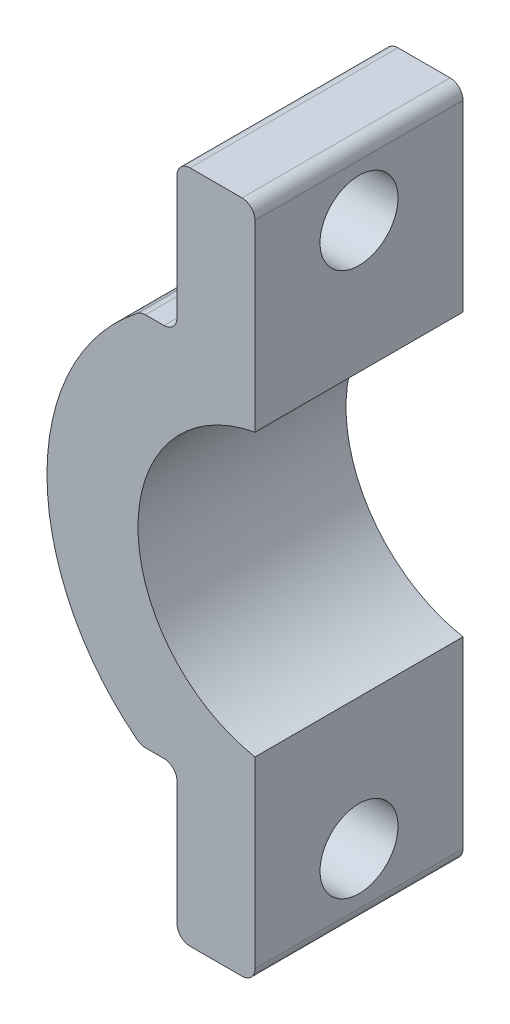
ISO-10303-21;
HEADER;
FILE_DESCRIPTION(('STEP AP214'),'2;1');
FILE_NAME('part.step','',(''),(''),'','','');
FILE_SCHEMA(('AUTOMOTIVE_DESIGN { 1 0 10303 214 1 1 1 1 }'));
ENDSEC;
DATA;
#1=APPLICATION_CONTEXT('core data for automotive mechanical design processes');
#2=APPLICATION_PROTOCOL_DEFINITION('international standard','automotive_design',2000,#1);
#3=PRODUCT_CONTEXT('',#1,'mechanical');
#4=PRODUCT('Part','Part','',(#3));
#5=PRODUCT_RELATED_PRODUCT_CATEGORY('part','',(#4));
#6=PRODUCT_DEFINITION_FORMATION('','',#4);
#7=PRODUCT_DEFINITION_CONTEXT('part definition',#1,'design');
#8=PRODUCT_DEFINITION('design','',#6,#7);
#9=PRODUCT_DEFINITION_SHAPE('','',#8);
#10=(LENGTH_UNIT() NAMED_UNIT(*) SI_UNIT(.MILLI.,.METRE.));
#11=(NAMED_UNIT(*) PLANE_ANGLE_UNIT() SI_UNIT($,.RADIAN.));
#12=(NAMED_UNIT(*) SI_UNIT($,.STERADIAN.) SOLID_ANGLE_UNIT());
#13=UNCERTAINTY_MEASURE_WITH_UNIT(LENGTH_MEASURE(1.E-05),#10,'distance_accuracy_value','');
#14=(GEOMETRIC_REPRESENTATION_CONTEXT(3) GLOBAL_UNCERTAINTY_ASSIGNED_CONTEXT((#13)) GLOBAL_UNIT_ASSIGNED_CONTEXT((#10,
#11,#12)) REPRESENTATION_CONTEXT('',''));
#15=CARTESIAN_POINT('',(0.,0.,0.));
#16=DIRECTION('',(0.,0.,1.));
#17=DIRECTION('',(1.,0.,0.));
#18=AXIS2_PLACEMENT_3D('',#15,#16,#17);
#19=CARTESIAN_POINT('',(0.,0.,8.));
#20=DIRECTION('',(0.,0.,1.));
#21=DIRECTION('',(1.,0.,0.));
#22=AXIS2_PLACEMENT_3D('',#19,#20,#21);
#23=PLANE('',#22);
#24=CARTESIAN_POINT('',(0.,0.,8.));
#25=DIRECTION('',(0.,0.,-1.));
#26=DIRECTION('',(1.,0.,0.));
#27=AXIS2_PLACEMENT_3D('',#24,#25,#26);
#28=CIRCLE('',#27,9.);
#29=CARTESIAN_POINT('',(-5.52275871873927,-7.10627442015782,8.));
#30=VERTEX_POINT('',#29);
#31=CARTESIAN_POINT('',(-5.52275871873927,7.10627442015782,8.));
#32=VERTEX_POINT('',#31);
#33=EDGE_CURVE('E271',#30,#32,#28,.T.);
#34=ORIENTED_EDGE('',*,*,#33,.F.);
#35=CARTESIAN_POINT('',(-5.21593878992042,-6.71148139681572,8.));
#36=DIRECTION('',(0.,0.,1.));
#37=DIRECTION('',(1.,0.,0.));
#38=AXIS2_PLACEMENT_3D('',#35,#36,#37);
#39=CIRCLE('',#38,0.5);
#40=CARTESIAN_POINT('',(-5.21593878992042,-7.21148139681572,8.));
#41=VERTEX_POINT('',#40);
#42=EDGE_CURVE('E43',#30,#41,#39,.T.);
#43=ORIENTED_EDGE('',*,*,#42,.T.);
#44=DIRECTION('',(-1.,0.,0.));
#45=VECTOR('',#44,1.);
#46=CARTESIAN_POINT('',(-4.,-7.21148139681572,8.));
#47=LINE('',#46,#45);
#48=CARTESIAN_POINT('',(-4.5,-7.21148139681572,8.));
#49=VERTEX_POINT('',#48);
#50=EDGE_CURVE('E270',#49,#41,#47,.T.);
#51=ORIENTED_EDGE('',*,*,#50,.F.);
#52=CARTESIAN_POINT('',(-4.5,-7.71148139681572,8.));
#53=DIRECTION('',(0.,0.,1.));
#54=DIRECTION('',(1.,0.,0.));
#55=AXIS2_PLACEMENT_3D('',#52,#53,#54);
#56=CIRCLE('',#55,0.5);
#57=CARTESIAN_POINT('',(-4.,-7.71148139681572,8.));
#58=VERTEX_POINT('',#57);
#59=EDGE_CURVE('E230',#49,#58,#56,.F.);
#60=ORIENTED_EDGE('',*,*,#59,.T.);
#61=DIRECTION('',(0.,1.,0.));
#62=VECTOR('',#61,1.);
#63=CARTESIAN_POINT('',(-4.,-7.21148139681572,8.));
#64=LINE('',#63,#62);
#65=CARTESIAN_POINT('',(-4.,-12.4614813968157,8.));
#66=VERTEX_POINT('',#65);
#67=EDGE_CURVE('E281',#66,#58,#64,.T.);
#68=ORIENTED_EDGE('',*,*,#67,.F.);
#69=CARTESIAN_POINT('',(-3.5,-12.4614813968157,8.));
#70=DIRECTION('',(0.,0.,1.));
#71=DIRECTION('',(1.,0.,0.));
#72=AXIS2_PLACEMENT_3D('',#69,#70,#71);
#73=CIRCLE('',#72,0.5);
#74=CARTESIAN_POINT('',(-3.5,-12.9614813968157,8.));
#75=VERTEX_POINT('',#74);
#76=EDGE_CURVE('E211',#66,#75,#73,.T.);
#77=ORIENTED_EDGE('',*,*,#76,.T.);
#78=DIRECTION('',(-1.,0.,0.));
#79=VECTOR('',#78,1.);
#80=CARTESIAN_POINT('',(-4.,-12.9614813968157,8.));
#81=LINE('',#80,#79);
#82=CARTESIAN_POINT('',(-1.5,-12.9614813968157,8.));
#83=VERTEX_POINT('',#82);
#84=EDGE_CURVE('E328',#83,#75,#81,.T.);
#85=ORIENTED_EDGE('',*,*,#84,.F.);
#86=CARTESIAN_POINT('',(-1.5,-12.4614813968157,8.));
#87=DIRECTION('',(0.,0.,1.));
#88=DIRECTION('',(1.,0.,0.));
#89=AXIS2_PLACEMENT_3D('',#86,#87,#88);
#90=CIRCLE('',#89,0.5);
#91=CARTESIAN_POINT('',(-1.,-12.4614813968157,8.));
#92=VERTEX_POINT('',#91);
#93=EDGE_CURVE('E177',#83,#92,#90,.T.);
#94=ORIENTED_EDGE('',*,*,#93,.T.);
#95=DIRECTION('',(0.,-1.,0.));
#96=VECTOR('',#95,1.);
#97=CARTESIAN_POINT('',(-1.,24.2431667663396,8.));
#98=LINE('',#97,#96);
#99=CARTESIAN_POINT('',(-1.,-5.40832691319598,8.));
#100=VERTEX_POINT('',#99);
#101=EDGE_CURVE('E163',#100,#92,#98,.T.);
#102=ORIENTED_EDGE('',*,*,#101,.F.);
#103=CARTESIAN_POINT('',(0.,0.,8.));
#104=DIRECTION('',(0.,0.,1.));
#105=DIRECTION('',(1.,0.,0.));
#106=AXIS2_PLACEMENT_3D('',#103,#104,#105);
#107=CIRCLE('',#106,5.5);
#108=CARTESIAN_POINT('',(-1.,5.40832691319598,8.));
#109=VERTEX_POINT('',#108);
#110=EDGE_CURVE('E172',#109,#100,#107,.T.);
#111=ORIENTED_EDGE('',*,*,#110,.F.);
#112=CARTESIAN_POINT('',(-1.,12.4614813968157,8.));
#113=VERTEX_POINT('',#112);
#114=EDGE_CURVE('E178',#113,#109,#98,.T.);
#115=ORIENTED_EDGE('',*,*,#114,.F.);
#116=CARTESIAN_POINT('',(-1.5,12.4614813968157,8.));
#117=DIRECTION('',(0.,0.,1.));
#118=DIRECTION('',(1.,0.,0.));
#119=AXIS2_PLACEMENT_3D('',#116,#117,#118);
#120=CIRCLE('',#119,0.5);
#121=CARTESIAN_POINT('',(-1.5,12.9614813968157,8.));
#122=VERTEX_POINT('',#121);
#123=EDGE_CURVE('E242',#113,#122,#120,.T.);
#124=ORIENTED_EDGE('',*,*,#123,.T.);
#125=DIRECTION('',(1.,0.,0.));
#126=VECTOR('',#125,1.);
#127=CARTESIAN_POINT('',(-4.,12.9614813968157,8.));
#128=LINE('',#127,#126);
#129=CARTESIAN_POINT('',(-3.5,12.9614813968157,8.));
#130=VERTEX_POINT('',#129);
#131=EDGE_CURVE('E296',#130,#122,#128,.T.);
#132=ORIENTED_EDGE('',*,*,#131,.F.);
#133=CARTESIAN_POINT('',(-3.5,12.4614813968157,8.));
#134=DIRECTION('',(0.,0.,1.));
#135=DIRECTION('',(1.,0.,0.));
#136=AXIS2_PLACEMENT_3D('',#133,#134,#135);
#137=CIRCLE('',#136,0.5);
#138=CARTESIAN_POINT('',(-4.,12.4614813968157,8.));
#139=VERTEX_POINT('',#138);
#140=EDGE_CURVE('E208',#130,#139,#137,.T.);
#141=ORIENTED_EDGE('',*,*,#140,.T.);
#142=DIRECTION('',(0.,1.,0.));
#143=VECTOR('',#142,1.);
#144=CARTESIAN_POINT('',(-4.,21.0444914195402,8.));
#145=LINE('',#144,#143);
#146=CARTESIAN_POINT('',(-4.,7.71148139681573,8.));
#147=VERTEX_POINT('',#146);
#148=EDGE_CURVE('E304',#147,#139,#145,.T.);
#149=ORIENTED_EDGE('',*,*,#148,.F.);
#150=CARTESIAN_POINT('',(-4.5,7.71148139681572,8.));
#151=DIRECTION('',(0.,0.,1.));
#152=DIRECTION('',(1.,0.,0.));
#153=AXIS2_PLACEMENT_3D('',#150,#151,#152);
#154=CIRCLE('',#153,0.5);
#155=CARTESIAN_POINT('',(-4.5,7.21148139681572,8.));
#156=VERTEX_POINT('',#155);
#157=EDGE_CURVE('E234',#147,#156,#154,.F.);
#158=ORIENTED_EDGE('',*,*,#157,.T.);
#159=DIRECTION('',(1.,0.,0.));
#160=VECTOR('',#159,1.);
#161=CARTESIAN_POINT('',(-28.8712300204423,7.21148139681572,8.));
#162=LINE('',#161,#160);
#163=CARTESIAN_POINT('',(-5.21593878992042,7.21148139681572,8.));
#164=VERTEX_POINT('',#163);
#165=EDGE_CURVE('E306',#164,#156,#162,.T.);
#166=ORIENTED_EDGE('',*,*,#165,.F.);
#167=CARTESIAN_POINT('',(-5.21593878992042,6.71148139681572,8.));
#168=DIRECTION('',(0.,0.,1.));
#169=DIRECTION('',(1.,0.,0.));
#170=AXIS2_PLACEMENT_3D('',#167,#168,#169);
#171=CIRCLE('',#170,0.5);
#172=EDGE_CURVE('E50',#164,#32,#171,.T.);
#173=ORIENTED_EDGE('',*,*,#172,.T.);
#174=EDGE_LOOP('',(#34,#43,#51,#60,#68,#77,#85,#94,#102,#111,#115,#124,#132,#141,#149,#158,#166,#173));
#175=FACE_BOUND('',#174,.T.);
#176=ADVANCED_FACE('F35',(#175),#23,.T.);
#177=CARTESIAN_POINT('',(0.,0.,0.));
#178=DIRECTION('',(0.,0.,1.));
#179=DIRECTION('',(1.,0.,0.));
#180=AXIS2_PLACEMENT_3D('',#177,#178,#179);
#181=PLANE('',#180);
#182=DIRECTION('',(-1.,0.,0.));
#183=VECTOR('',#182,1.);
#184=CARTESIAN_POINT('',(-4.,-7.21148139681572,0.));
#185=LINE('',#184,#183);
#186=CARTESIAN_POINT('',(-4.5,-7.21148139681572,0.));
#187=VERTEX_POINT('',#186);
#188=CARTESIAN_POINT('',(-5.21593878992042,-7.21148139681572,0.));
#189=VERTEX_POINT('',#188);
#190=EDGE_CURVE('E290',#187,#189,#185,.T.);
#191=ORIENTED_EDGE('',*,*,#190,.T.);
#192=CARTESIAN_POINT('',(-5.21593878992042,-6.71148139681572,0.));
#193=DIRECTION('',(0.,0.,1.));
#194=DIRECTION('',(1.,0.,0.));
#195=AXIS2_PLACEMENT_3D('',#192,#193,#194);
#196=CIRCLE('',#195,0.5);
#197=CARTESIAN_POINT('',(-5.52275871873927,-7.10627442015782,0.));
#198=VERTEX_POINT('',#197);
#199=EDGE_CURVE('E261',#189,#198,#196,.F.);
#200=ORIENTED_EDGE('',*,*,#199,.T.);
#201=CARTESIAN_POINT('',(0.,0.,0.));
#202=DIRECTION('',(0.,0.,-1.));
#203=DIRECTION('',(1.,0.,0.));
#204=AXIS2_PLACEMENT_3D('',#201,#202,#203);
#205=CIRCLE('',#204,9.);
#206=CARTESIAN_POINT('',(-5.52275871873927,7.10627442015782,0.));
#207=VERTEX_POINT('',#206);
#208=EDGE_CURVE('E288',#198,#207,#205,.T.);
#209=ORIENTED_EDGE('',*,*,#208,.T.);
#210=CARTESIAN_POINT('',(-5.21593878992042,6.71148139681572,0.));
#211=DIRECTION('',(0.,0.,1.));
#212=DIRECTION('',(1.,0.,0.));
#213=AXIS2_PLACEMENT_3D('',#210,#211,#212);
#214=CIRCLE('',#213,0.5);
#215=CARTESIAN_POINT('',(-5.21593878992042,7.21148139681572,0.));
#216=VERTEX_POINT('',#215);
#217=EDGE_CURVE('E259',#207,#216,#214,.F.);
#218=ORIENTED_EDGE('',*,*,#217,.T.);
#219=DIRECTION('',(1.,0.,0.));
#220=VECTOR('',#219,1.);
#221=CARTESIAN_POINT('',(-28.8712300204423,7.21148139681572,0.));
#222=LINE('',#221,#220);
#223=CARTESIAN_POINT('',(-4.5,7.21148139681572,0.));
#224=VERTEX_POINT('',#223);
#225=EDGE_CURVE('E302',#216,#224,#222,.T.);
#226=ORIENTED_EDGE('',*,*,#225,.T.);
#227=CARTESIAN_POINT('',(-4.5,7.71148139681572,0.));
#228=DIRECTION('',(0.,0.,1.));
#229=DIRECTION('',(1.,0.,0.));
#230=AXIS2_PLACEMENT_3D('',#227,#228,#229);
#231=CIRCLE('',#230,0.5);
#232=CARTESIAN_POINT('',(-4.,7.71148139681573,0.));
#233=VERTEX_POINT('',#232);
#234=EDGE_CURVE('E237',#224,#233,#231,.T.);
#235=ORIENTED_EDGE('',*,*,#234,.T.);
#236=DIRECTION('',(0.,1.,0.));
#237=VECTOR('',#236,1.);
#238=CARTESIAN_POINT('',(-4.,21.0444914195402,0.));
#239=LINE('',#238,#237);
#240=CARTESIAN_POINT('',(-4.,12.4614813968157,0.));
#241=VERTEX_POINT('',#240);
#242=EDGE_CURVE('E179',#233,#241,#239,.T.);
#243=ORIENTED_EDGE('',*,*,#242,.T.);
#244=CARTESIAN_POINT('',(-3.5,12.4614813968157,0.));
#245=DIRECTION('',(0.,0.,1.));
#246=DIRECTION('',(1.,0.,0.));
#247=AXIS2_PLACEMENT_3D('',#244,#245,#246);
#248=CIRCLE('',#247,0.5);
#249=CARTESIAN_POINT('',(-3.5,12.9614813968157,0.));
#250=VERTEX_POINT('',#249);
#251=EDGE_CURVE('E202',#241,#250,#248,.F.);
#252=ORIENTED_EDGE('',*,*,#251,.T.);
#253=DIRECTION('',(1.,0.,0.));
#254=VECTOR('',#253,1.);
#255=CARTESIAN_POINT('',(-4.,12.9614813968157,0.));
#256=LINE('',#255,#254);
#257=CARTESIAN_POINT('',(-1.5,12.9614813968157,0.));
#258=VERTEX_POINT('',#257);
#259=EDGE_CURVE('E299',#250,#258,#256,.T.);
#260=ORIENTED_EDGE('',*,*,#259,.T.);
#261=CARTESIAN_POINT('',(-1.5,12.4614813968157,0.));
#262=DIRECTION('',(0.,0.,1.));
#263=DIRECTION('',(1.,0.,0.));
#264=AXIS2_PLACEMENT_3D('',#261,#262,#263);
#265=CIRCLE('',#264,0.5);
#266=CARTESIAN_POINT('',(-1.,12.4614813968157,0.));
#267=VERTEX_POINT('',#266);
#268=EDGE_CURVE('E247',#258,#267,#265,.F.);
#269=ORIENTED_EDGE('',*,*,#268,.T.);
#270=DIRECTION('',(0.,-1.,0.));
#271=VECTOR('',#270,1.);
#272=CARTESIAN_POINT('',(-1.,24.2431667663396,0.));
#273=LINE('',#272,#271);
#274=CARTESIAN_POINT('',(-1.,5.40832691319598,0.));
#275=VERTEX_POINT('',#274);
#276=EDGE_CURVE('E186',#267,#275,#273,.T.);
#277=ORIENTED_EDGE('',*,*,#276,.T.);
#278=CARTESIAN_POINT('',(0.,0.,0.));
#279=DIRECTION('',(0.,0.,1.));
#280=DIRECTION('',(1.,0.,0.));
#281=AXIS2_PLACEMENT_3D('',#278,#279,#280);
#282=CIRCLE('',#281,5.5);
#283=CARTESIAN_POINT('',(-1.,-5.40832691319598,0.));
#284=VERTEX_POINT('',#283);
#285=EDGE_CURVE('E184',#275,#284,#282,.T.);
#286=ORIENTED_EDGE('',*,*,#285,.T.);
#287=CARTESIAN_POINT('',(-1.,-12.4614813968157,0.));
#288=VERTEX_POINT('',#287);
#289=EDGE_CURVE('E166',#284,#288,#273,.T.);
#290=ORIENTED_EDGE('',*,*,#289,.T.);
#291=CARTESIAN_POINT('',(-1.5,-12.4614813968157,0.));
#292=DIRECTION('',(0.,0.,1.));
#293=DIRECTION('',(1.,0.,0.));
#294=AXIS2_PLACEMENT_3D('',#291,#292,#293);
#295=CIRCLE('',#294,0.5);
#296=CARTESIAN_POINT('',(-1.5,-12.9614813968157,0.));
#297=VERTEX_POINT('',#296);
#298=EDGE_CURVE('E249',#288,#297,#295,.F.);
#299=ORIENTED_EDGE('',*,*,#298,.T.);
#300=DIRECTION('',(-1.,0.,0.));
#301=VECTOR('',#300,1.);
#302=CARTESIAN_POINT('',(-4.,-12.9614813968157,0.));
#303=LINE('',#302,#301);
#304=CARTESIAN_POINT('',(-3.5,-12.9614813968157,0.));
#305=VERTEX_POINT('',#304);
#306=EDGE_CURVE('E199',#297,#305,#303,.T.);
#307=ORIENTED_EDGE('',*,*,#306,.T.);
#308=CARTESIAN_POINT('',(-3.5,-12.4614813968157,0.));
#309=DIRECTION('',(0.,0.,1.));
#310=DIRECTION('',(1.,0.,0.));
#311=AXIS2_PLACEMENT_3D('',#308,#309,#310);
#312=CIRCLE('',#311,0.5);
#313=CARTESIAN_POINT('',(-4.,-12.4614813968157,0.));
#314=VERTEX_POINT('',#313);
#315=EDGE_CURVE('E204',#305,#314,#312,.F.);
#316=ORIENTED_EDGE('',*,*,#315,.T.);
#317=DIRECTION('',(0.,1.,0.));
#318=VECTOR('',#317,1.);
#319=CARTESIAN_POINT('',(-4.,-7.21148139681572,0.));
#320=LINE('',#319,#318);
#321=CARTESIAN_POINT('',(-4.,-7.71148139681572,0.));
#322=VERTEX_POINT('',#321);
#323=EDGE_CURVE('E280',#314,#322,#320,.T.);
#324=ORIENTED_EDGE('',*,*,#323,.T.);
#325=CARTESIAN_POINT('',(-4.5,-7.71148139681572,0.));
#326=DIRECTION('',(0.,0.,1.));
#327=DIRECTION('',(1.,0.,0.));
#328=AXIS2_PLACEMENT_3D('',#325,#326,#327);
#329=CIRCLE('',#328,0.5);
#330=EDGE_CURVE('E232',#322,#187,#329,.T.);
#331=ORIENTED_EDGE('',*,*,#330,.T.);
#332=EDGE_LOOP('',(#191,#200,#209,#218,#226,#235,#243,#252,#260,#269,#277,#286,#290,#299,#307,
#316,#324,#331));
#333=FACE_BOUND('',#332,.T.);
#334=ADVANCED_FACE('F287',(#333),#181,.F.);
#335=CARTESIAN_POINT('',(0.,0.,8.));
#336=DIRECTION('',(0.,0.,-1.));
#337=DIRECTION('',(-1.,0.,0.));
#338=AXIS2_PLACEMENT_3D('',#335,#336,#337);
#339=CYLINDRICAL_SURFACE('',#338,5.5);
#340=DIRECTION('',(0.,0.,-1.));
#341=VECTOR('',#340,1.);
#342=CARTESIAN_POINT('',(-1.,5.40832691319598,8.));
#343=LINE('',#342,#341);
#344=EDGE_CURVE('E171',#109,#275,#343,.T.);
#345=ORIENTED_EDGE('',*,*,#344,.F.);
#346=ORIENTED_EDGE('',*,*,#110,.T.);
#347=DIRECTION('',(0.,0.,-1.));
#348=VECTOR('',#347,1.);
#349=CARTESIAN_POINT('',(-1.,-5.40832691319598,8.));
#350=LINE('',#349,#348);
#351=EDGE_CURVE('E160',#284,#100,#350,.F.);
#352=ORIENTED_EDGE('',*,*,#351,.F.);
#353=ORIENTED_EDGE('',*,*,#285,.F.);
#354=EDGE_LOOP('',(#345,#346,#352,#353));
#355=FACE_BOUND('',#354,.T.);
#356=ADVANCED_FACE('F182',(#355),#339,.F.);
#357=CARTESIAN_POINT('',(-1.,24.2431667663396,0.));
#358=DIRECTION('',(-1.,0.,0.));
#359=DIRECTION('',(0.,-1.,0.));
#360=AXIS2_PLACEMENT_3D('',#357,#358,#359);
#361=PLANE('',#360);
#362=CARTESIAN_POINT('',(-1.,-10.4614813968157,4.));
#363=DIRECTION('',(1.,0.,0.));
#364=DIRECTION('',(0.,1.,0.));
#365=AXIS2_PLACEMENT_3D('',#362,#363,#364);
#366=CIRCLE('',#365,1.5);
#367=CARTESIAN_POINT('',(-1.,-8.96148139681572,4.));
#368=VERTEX_POINT('',#367);
#369=EDGE_CURVE('E333',#368,#368,#366,.T.);
#370=ORIENTED_EDGE('',*,*,#369,.F.);
#371=EDGE_LOOP('',(#370));
#372=FACE_BOUND('',#371,.T.);
#373=ORIENTED_EDGE('',*,*,#101,.T.);
#374=DIRECTION('',(0.,0.,1.));
#375=VECTOR('',#374,1.);
#376=CARTESIAN_POINT('',(-1.,-12.4614813968157,0.));
#377=LINE('',#376,#375);
#378=EDGE_CURVE('E245',#92,#288,#377,.F.);
#379=ORIENTED_EDGE('',*,*,#378,.T.);
#380=ORIENTED_EDGE('',*,*,#289,.F.);
#381=ORIENTED_EDGE('',*,*,#351,.T.);
#382=EDGE_LOOP('',(#373,#379,#380,#381));
#383=FACE_BOUND('',#382,.T.);
#384=ADVANCED_FACE('F162',(#372,#383),#361,.F.);
#385=CARTESIAN_POINT('',(-1.,10.4614813968157,4.));
#386=DIRECTION('',(1.,0.,0.));
#387=DIRECTION('',(0.,1.,0.));
#388=AXIS2_PLACEMENT_3D('',#385,#386,#387);
#389=CIRCLE('',#388,1.5);
#390=CARTESIAN_POINT('',(-1.,11.9614813968157,4.));
#391=VERTEX_POINT('',#390);
#392=EDGE_CURVE('E196',#391,#391,#389,.T.);
#393=ORIENTED_EDGE('',*,*,#392,.F.);
#394=EDGE_LOOP('',(#393));
#395=FACE_BOUND('',#394,.T.);
#396=ORIENTED_EDGE('',*,*,#276,.F.);
#397=DIRECTION('',(0.,0.,-1.));
#398=VECTOR('',#397,1.);
#399=CARTESIAN_POINT('',(-1.,12.4614813968157,8.));
#400=LINE('',#399,#398);
#401=EDGE_CURVE('E254',#267,#113,#400,.F.);
#402=ORIENTED_EDGE('',*,*,#401,.T.);
#403=ORIENTED_EDGE('',*,*,#114,.T.);
#404=ORIENTED_EDGE('',*,*,#344,.T.);
#405=EDGE_LOOP('',(#396,#402,#403,#404));
#406=FACE_BOUND('',#405,.T.);
#407=ADVANCED_FACE('F314',(#395,#406),#361,.F.);
#408=CARTESIAN_POINT('',(-4.,-7.21148139681572,0.));
#409=DIRECTION('',(0.,1.,0.));
#410=DIRECTION('',(-1.,0.,0.));
#411=AXIS2_PLACEMENT_3D('',#408,#409,#410);
#412=PLANE('',#411);
#413=ORIENTED_EDGE('',*,*,#50,.T.);
#414=DIRECTION('',(0.,0.,1.));
#415=VECTOR('',#414,1.);
#416=CARTESIAN_POINT('',(-5.21593878992042,-7.21148139681572,0.));
#417=LINE('',#416,#415);
#418=EDGE_CURVE('E256',#41,#189,#417,.F.);
#419=ORIENTED_EDGE('',*,*,#418,.T.);
#420=ORIENTED_EDGE('',*,*,#190,.F.);
#421=DIRECTION('',(0.,0.,1.));
#422=VECTOR('',#421,1.);
#423=CARTESIAN_POINT('',(-4.5,-7.21148139681572,8.));
#424=LINE('',#423,#422);
#425=EDGE_CURVE('E219',#187,#49,#424,.T.);
#426=ORIENTED_EDGE('',*,*,#425,.T.);
#427=EDGE_LOOP('',(#413,#419,#420,#426));
#428=FACE_BOUND('',#427,.T.);
#429=ADVANCED_FACE('F276',(#428),#412,.F.);
#430=CARTESIAN_POINT('',(-4.,-7.21148139681572,0.));
#431=DIRECTION('',(1.,0.,0.));
#432=DIRECTION('',(0.,1.,0.));
#433=AXIS2_PLACEMENT_3D('',#430,#431,#432);
#434=PLANE('',#433);
#435=CARTESIAN_POINT('',(-4.,-10.4614813968157,4.));
#436=DIRECTION('',(1.,0.,0.));
#437=DIRECTION('',(0.,1.,0.));
#438=AXIS2_PLACEMENT_3D('',#435,#436,#437);
#439=CIRCLE('',#438,1.5);
#440=CARTESIAN_POINT('',(-4.,-8.96148139681572,4.));
#441=VERTEX_POINT('',#440);
#442=EDGE_CURVE('E195',#441,#441,#439,.T.);
#443=ORIENTED_EDGE('',*,*,#442,.T.);
#444=EDGE_LOOP('',(#443));
#445=FACE_BOUND('',#444,.T.);
#446=ORIENTED_EDGE('',*,*,#67,.T.);
#447=DIRECTION('',(0.,0.,1.));
#448=VECTOR('',#447,1.);
#449=CARTESIAN_POINT('',(-4.,-7.71148139681572,0.));
#450=LINE('',#449,#448);
#451=EDGE_CURVE('E222',#58,#322,#450,.F.);
#452=ORIENTED_EDGE('',*,*,#451,.T.);
#453=ORIENTED_EDGE('',*,*,#323,.F.);
#454=DIRECTION('',(0.,0.,-1.));
#455=VECTOR('',#454,1.);
#456=CARTESIAN_POINT('',(-4.,-12.4614813968157,8.));
#457=LINE('',#456,#455);
#458=EDGE_CURVE('E206',#314,#66,#457,.F.);
#459=ORIENTED_EDGE('',*,*,#458,.T.);
#460=EDGE_LOOP('',(#446,#452,#453,#459));
#461=FACE_BOUND('',#460,.T.);
#462=ADVANCED_FACE('F349',(#445,#461),#434,.F.);
#463=CARTESIAN_POINT('',(-28.8712300204423,7.21148139681572,0.));
#464=DIRECTION('',(0.,-1.,0.));
#465=DIRECTION('',(0.,0.,-1.));
#466=AXIS2_PLACEMENT_3D('',#463,#464,#465);
#467=PLANE('',#466);
#468=ORIENTED_EDGE('',*,*,#225,.F.);
#469=DIRECTION('',(0.,0.,1.));
#470=VECTOR('',#469,1.);
#471=CARTESIAN_POINT('',(-5.21593878992042,7.21148139681572,0.));
#472=LINE('',#471,#470);
#473=EDGE_CURVE('E11',#216,#164,#472,.T.);
#474=ORIENTED_EDGE('',*,*,#473,.T.);
#475=ORIENTED_EDGE('',*,*,#165,.T.);
#476=DIRECTION('',(0.,0.,1.));
#477=VECTOR('',#476,1.);
#478=CARTESIAN_POINT('',(-4.5,7.21148139681572,0.));
#479=LINE('',#478,#477);
#480=EDGE_CURVE('E227',#156,#224,#479,.F.);
#481=ORIENTED_EDGE('',*,*,#480,.T.);
#482=EDGE_LOOP('',(#468,#474,#475,#481));
#483=FACE_BOUND('',#482,.T.);
#484=ADVANCED_FACE('F392',(#483),#467,.F.);
#485=CARTESIAN_POINT('',(-4.,21.0444914195402,0.));
#486=DIRECTION('',(1.,0.,0.));
#487=DIRECTION('',(0.,0.,-1.));
#488=AXIS2_PLACEMENT_3D('',#485,#486,#487);
#489=PLANE('',#488);
#490=CARTESIAN_POINT('',(-4.,10.4614813968157,4.));
#491=DIRECTION('',(1.,0.,0.));
#492=DIRECTION('',(0.,0.,-1.));
#493=AXIS2_PLACEMENT_3D('',#490,#491,#492);
#494=CIRCLE('',#493,1.5);
#495=CARTESIAN_POINT('',(-4.,10.4614813968157,2.5));
#496=VERTEX_POINT('',#495);
#497=EDGE_CURVE('E192',#496,#496,#494,.T.);
#498=ORIENTED_EDGE('',*,*,#497,.T.);
#499=EDGE_LOOP('',(#498));
#500=FACE_BOUND('',#499,.T.);
#501=ORIENTED_EDGE('',*,*,#242,.F.);
#502=DIRECTION('',(0.,0.,1.));
#503=VECTOR('',#502,1.);
#504=CARTESIAN_POINT('',(-4.,7.71148139681572,8.));
#505=LINE('',#504,#503);
#506=EDGE_CURVE('E224',#233,#147,#505,.T.);
#507=ORIENTED_EDGE('',*,*,#506,.T.);
#508=ORIENTED_EDGE('',*,*,#148,.T.);
#509=DIRECTION('',(0.,0.,-1.));
#510=VECTOR('',#509,1.);
#511=CARTESIAN_POINT('',(-4.,12.4614813968157,0.));
#512=LINE('',#511,#510);
#513=EDGE_CURVE('E214',#139,#241,#512,.T.);
#514=ORIENTED_EDGE('',*,*,#513,.T.);
#515=EDGE_LOOP('',(#501,#507,#508,#514));
#516=FACE_BOUND('',#515,.T.);
#517=ADVANCED_FACE('F398',(#500,#516),#489,.F.);
#518=CARTESIAN_POINT('',(0.,0.,0.));
#519=DIRECTION('',(0.,0.,1.));
#520=DIRECTION('',(1.,0.,0.));
#521=AXIS2_PLACEMENT_3D('',#518,#519,#520);
#522=CYLINDRICAL_SURFACE('',#521,9.);
#523=ORIENTED_EDGE('',*,*,#208,.F.);
#524=DIRECTION('',(0.,0.,1.));
#525=VECTOR('',#524,1.);
#526=CARTESIAN_POINT('',(-5.52275871873927,-7.10627442015782,0.));
#527=LINE('',#526,#525);
#528=EDGE_CURVE('E265',#198,#30,#527,.T.);
#529=ORIENTED_EDGE('',*,*,#528,.T.);
#530=ORIENTED_EDGE('',*,*,#33,.T.);
#531=DIRECTION('',(0.,0.,1.));
#532=VECTOR('',#531,1.);
#533=CARTESIAN_POINT('',(-5.52275871873927,7.10627442015782,0.));
#534=LINE('',#533,#532);
#535=EDGE_CURVE('E263',#32,#207,#534,.F.);
#536=ORIENTED_EDGE('',*,*,#535,.T.);
#537=EDGE_LOOP('',(#523,#529,#530,#536));
#538=FACE_BOUND('',#537,.T.);
#539=ADVANCED_FACE('F292',(#538),#522,.T.);
#540=CARTESIAN_POINT('',(-4.,12.9614813968157,8.));
#541=DIRECTION('',(0.,1.,0.));
#542=DIRECTION('',(0.,0.,1.));
#543=AXIS2_PLACEMENT_3D('',#540,#541,#542);
#544=PLANE('',#543);
#545=ORIENTED_EDGE('',*,*,#131,.T.);
#546=DIRECTION('',(0.,0.,-1.));
#547=VECTOR('',#546,1.);
#548=CARTESIAN_POINT('',(-1.5,12.9614813968157,0.));
#549=LINE('',#548,#547);
#550=EDGE_CURVE('E251',#122,#258,#549,.T.);
#551=ORIENTED_EDGE('',*,*,#550,.T.);
#552=ORIENTED_EDGE('',*,*,#259,.F.);
#553=DIRECTION('',(0.,0.,-1.));
#554=VECTOR('',#553,1.);
#555=CARTESIAN_POINT('',(-3.5,12.9614813968157,8.));
#556=LINE('',#555,#554);
#557=EDGE_CURVE('E217',#250,#130,#556,.F.);
#558=ORIENTED_EDGE('',*,*,#557,.T.);
#559=EDGE_LOOP('',(#545,#551,#552,#558));
#560=FACE_BOUND('',#559,.T.);
#561=ADVANCED_FACE('F325',(#560),#544,.T.);
#562=CARTESIAN_POINT('',(-4.,-12.9614813968157,8.));
#563=DIRECTION('',(0.,-1.,0.));
#564=DIRECTION('',(0.,0.,-1.));
#565=AXIS2_PLACEMENT_3D('',#562,#563,#564);
#566=PLANE('',#565);
#567=ORIENTED_EDGE('',*,*,#306,.F.);
#568=DIRECTION('',(0.,0.,1.));
#569=VECTOR('',#568,1.);
#570=CARTESIAN_POINT('',(-1.5,-12.9614813968157,8.));
#571=LINE('',#570,#569);
#572=EDGE_CURVE('E239',#297,#83,#571,.T.);
#573=ORIENTED_EDGE('',*,*,#572,.T.);
#574=ORIENTED_EDGE('',*,*,#84,.T.);
#575=DIRECTION('',(0.,0.,-1.));
#576=VECTOR('',#575,1.);
#577=CARTESIAN_POINT('',(-3.5,-12.9614813968157,0.));
#578=LINE('',#577,#576);
#579=EDGE_CURVE('E191',#75,#305,#578,.T.);
#580=ORIENTED_EDGE('',*,*,#579,.T.);
#581=EDGE_LOOP('',(#567,#573,#574,#580));
#582=FACE_BOUND('',#581,.T.);
#583=ADVANCED_FACE('F429',(#582),#566,.T.);
#584=CARTESIAN_POINT('',(-9.,10.4614813968157,4.));
#585=DIRECTION('',(1.,0.,0.));
#586=DIRECTION('',(0.,1.,0.));
#587=AXIS2_PLACEMENT_3D('',#584,#585,#586);
#588=CYLINDRICAL_SURFACE('',#587,1.5);
#589=ORIENTED_EDGE('',*,*,#392,.T.);
#590=EDGE_LOOP('',(#589));
#591=FACE_BOUND('',#590,.T.);
#592=ORIENTED_EDGE('',*,*,#497,.F.);
#593=EDGE_LOOP('',(#592));
#594=FACE_BOUND('',#593,.T.);
#595=ADVANCED_FACE('F339',(#591,#594),#588,.F.);
#596=CARTESIAN_POINT('',(-9.,-10.4614813968157,4.));
#597=DIRECTION('',(1.,0.,0.));
#598=DIRECTION('',(0.,1.,0.));
#599=AXIS2_PLACEMENT_3D('',#596,#597,#598);
#600=CYLINDRICAL_SURFACE('',#599,1.5);
#601=ORIENTED_EDGE('',*,*,#369,.T.);
#602=EDGE_LOOP('',(#601));
#603=FACE_BOUND('',#602,.T.);
#604=ORIENTED_EDGE('',*,*,#442,.F.);
#605=EDGE_LOOP('',(#604));
#606=FACE_BOUND('',#605,.T.);
#607=ADVANCED_FACE('F366',(#603,#606),#600,.F.);
#608=CARTESIAN_POINT('',(-3.5,-12.4614813968157,8.));
#609=DIRECTION('',(0.,0.,1.));
#610=DIRECTION('',(1.,0.,0.));
#611=AXIS2_PLACEMENT_3D('',#608,#609,#610);
#612=CYLINDRICAL_SURFACE('',#611,0.5);
#613=ORIENTED_EDGE('',*,*,#76,.F.);
#614=ORIENTED_EDGE('',*,*,#458,.F.);
#615=ORIENTED_EDGE('',*,*,#315,.F.);
#616=ORIENTED_EDGE('',*,*,#579,.F.);
#617=EDGE_LOOP('',(#613,#614,#615,#616));
#618=FACE_BOUND('',#617,.T.);
#619=ADVANCED_FACE('F362',(#618),#612,.T.);
#620=CARTESIAN_POINT('',(-3.5,12.4614813968157,0.));
#621=DIRECTION('',(0.,0.,1.));
#622=DIRECTION('',(1.,0.,0.));
#623=AXIS2_PLACEMENT_3D('',#620,#621,#622);
#624=CYLINDRICAL_SURFACE('',#623,0.5);
#625=ORIENTED_EDGE('',*,*,#140,.F.);
#626=ORIENTED_EDGE('',*,*,#557,.F.);
#627=ORIENTED_EDGE('',*,*,#251,.F.);
#628=ORIENTED_EDGE('',*,*,#513,.F.);
#629=EDGE_LOOP('',(#625,#626,#627,#628));
#630=FACE_BOUND('',#629,.T.);
#631=ADVANCED_FACE('F365',(#630),#624,.T.);
#632=CARTESIAN_POINT('',(-4.5,-7.71148139681572,0.));
#633=DIRECTION('',(0.,0.,-1.));
#634=DIRECTION('',(-1.,0.,0.));
#635=AXIS2_PLACEMENT_3D('',#632,#633,#634);
#636=CYLINDRICAL_SURFACE('',#635,0.5);
#637=ORIENTED_EDGE('',*,*,#330,.F.);
#638=ORIENTED_EDGE('',*,*,#451,.F.);
#639=ORIENTED_EDGE('',*,*,#59,.F.);
#640=ORIENTED_EDGE('',*,*,#425,.F.);
#641=EDGE_LOOP('',(#637,#638,#639,#640));
#642=FACE_BOUND('',#641,.T.);
#643=ADVANCED_FACE('F370',(#642),#636,.F.);
#644=CARTESIAN_POINT('',(-4.5,7.71148139681572,0.));
#645=DIRECTION('',(0.,0.,-1.));
#646=DIRECTION('',(-1.,0.,0.));
#647=AXIS2_PLACEMENT_3D('',#644,#645,#646);
#648=CYLINDRICAL_SURFACE('',#647,0.5);
#649=ORIENTED_EDGE('',*,*,#234,.F.);
#650=ORIENTED_EDGE('',*,*,#480,.F.);
#651=ORIENTED_EDGE('',*,*,#157,.F.);
#652=ORIENTED_EDGE('',*,*,#506,.F.);
#653=EDGE_LOOP('',(#649,#650,#651,#652));
#654=FACE_BOUND('',#653,.T.);
#655=ADVANCED_FACE('F374',(#654),#648,.F.);
#656=CARTESIAN_POINT('',(-1.5,-12.4614813968157,8.));
#657=DIRECTION('',(0.,0.,-1.));
#658=DIRECTION('',(-1.,0.,0.));
#659=AXIS2_PLACEMENT_3D('',#656,#657,#658);
#660=CYLINDRICAL_SURFACE('',#659,0.5);
#661=ORIENTED_EDGE('',*,*,#298,.F.);
#662=ORIENTED_EDGE('',*,*,#378,.F.);
#663=ORIENTED_EDGE('',*,*,#93,.F.);
#664=ORIENTED_EDGE('',*,*,#572,.F.);
#665=EDGE_LOOP('',(#661,#662,#663,#664));
#666=FACE_BOUND('',#665,.T.);
#667=ADVANCED_FACE('F378',(#666),#660,.T.);
#668=CARTESIAN_POINT('',(-1.5,12.4614813968157,8.));
#669=DIRECTION('',(0.,0.,1.));
#670=DIRECTION('',(1.,0.,0.));
#671=AXIS2_PLACEMENT_3D('',#668,#669,#670);
#672=CYLINDRICAL_SURFACE('',#671,0.5);
#673=ORIENTED_EDGE('',*,*,#123,.F.);
#674=ORIENTED_EDGE('',*,*,#401,.F.);
#675=ORIENTED_EDGE('',*,*,#268,.F.);
#676=ORIENTED_EDGE('',*,*,#550,.F.);
#677=EDGE_LOOP('',(#673,#674,#675,#676));
#678=FACE_BOUND('',#677,.T.);
#679=ADVANCED_FACE('F321',(#678),#672,.T.);
#680=CARTESIAN_POINT('',(-5.21593878992042,-6.71148139681572,0.));
#681=DIRECTION('',(0.,0.,1.));
#682=DIRECTION('',(1.,0.,0.));
#683=AXIS2_PLACEMENT_3D('',#680,#681,#682);
#684=CYLINDRICAL_SURFACE('',#683,0.5);
#685=ORIENTED_EDGE('',*,*,#42,.F.);
#686=ORIENTED_EDGE('',*,*,#528,.F.);
#687=ORIENTED_EDGE('',*,*,#199,.F.);
#688=ORIENTED_EDGE('',*,*,#418,.F.);
#689=EDGE_LOOP('',(#685,#686,#687,#688));
#690=FACE_BOUND('',#689,.T.);
#691=ADVANCED_FACE('F283',(#690),#684,.T.);
#692=CARTESIAN_POINT('',(-5.21593878992042,6.71148139681572,0.));
#693=DIRECTION('',(0.,0.,1.));
#694=DIRECTION('',(1.,0.,0.));
#695=AXIS2_PLACEMENT_3D('',#692,#693,#694);
#696=CYLINDRICAL_SURFACE('',#695,0.5);
#697=ORIENTED_EDGE('',*,*,#217,.F.);
#698=ORIENTED_EDGE('',*,*,#535,.F.);
#699=ORIENTED_EDGE('',*,*,#172,.F.);
#700=ORIENTED_EDGE('',*,*,#473,.F.);
#701=EDGE_LOOP('',(#697,#698,#699,#700));
#702=FACE_BOUND('',#701,.T.);
#703=ADVANCED_FACE('F37',(#702),#696,.T.);
#704=CLOSED_SHELL('',(#176,#334,#356,#384,#407,#429,#462,#484,#517,#539,#561,#583,#595,#607,
#619,#631,#643,#655,#667,#679,#691,#703));
#705=MANIFOLD_SOLID_BREP('B2',#704);
#706=ADVANCED_BREP_SHAPE_REPRESENTATION('',(#18,#705),#14);
#707=SHAPE_DEFINITION_REPRESENTATION(#9,#706);
ENDSEC;
END-ISO-10303-21;
